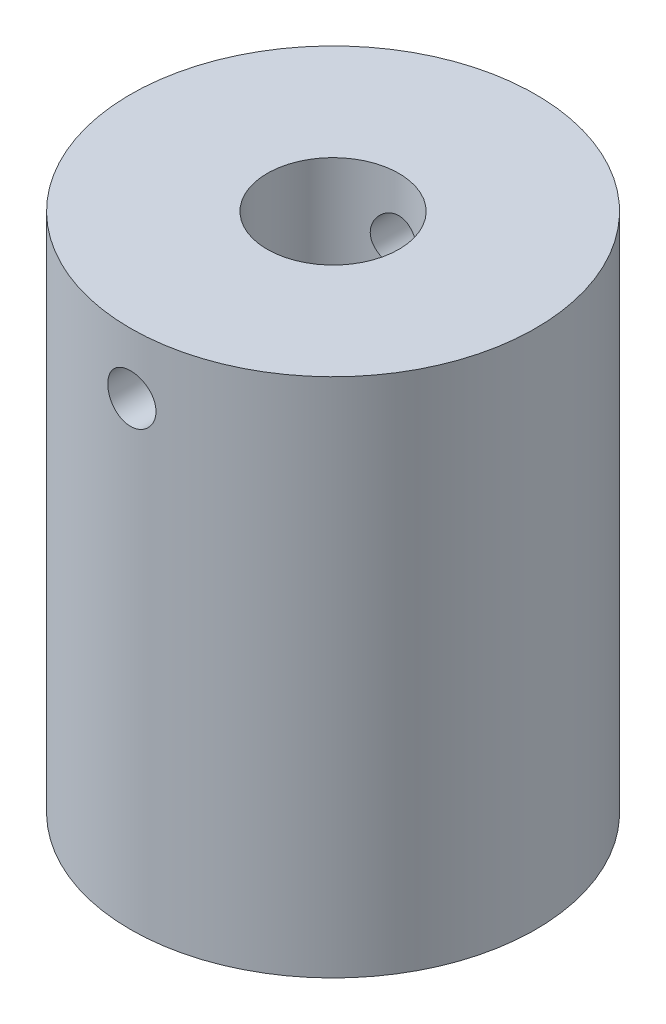
ISO-10303-21;
HEADER;
FILE_DESCRIPTION(('STEP AP214'),'2;1');
FILE_NAME('part.step','',(''),(''),'','','');
FILE_SCHEMA(('AUTOMOTIVE_DESIGN { 1 0 10303 214 1 1 1 1 }'));
ENDSEC;
DATA;
#1=APPLICATION_CONTEXT('core data for automotive mechanical design processes');
#2=APPLICATION_PROTOCOL_DEFINITION('international standard','automotive_design',2000,#1);
#3=PRODUCT_CONTEXT('',#1,'mechanical');
#4=PRODUCT('Part','Part','',(#3));
#5=PRODUCT_RELATED_PRODUCT_CATEGORY('part','',(#4));
#6=PRODUCT_DEFINITION_FORMATION('','',#4);
#7=PRODUCT_DEFINITION_CONTEXT('part definition',#1,'design');
#8=PRODUCT_DEFINITION('design','',#6,#7);
#9=PRODUCT_DEFINITION_SHAPE('','',#8);
#10=(LENGTH_UNIT() NAMED_UNIT(*) SI_UNIT(.MILLI.,.METRE.));
#11=(NAMED_UNIT(*) PLANE_ANGLE_UNIT() SI_UNIT($,.RADIAN.));
#12=(NAMED_UNIT(*) SI_UNIT($,.STERADIAN.) SOLID_ANGLE_UNIT());
#13=UNCERTAINTY_MEASURE_WITH_UNIT(LENGTH_MEASURE(1.E-05),#10,'distance_accuracy_value','');
#14=(GEOMETRIC_REPRESENTATION_CONTEXT(3) GLOBAL_UNCERTAINTY_ASSIGNED_CONTEXT((#13)) GLOBAL_UNIT_ASSIGNED_CONTEXT((#10,
#11,#12)) REPRESENTATION_CONTEXT('',''));
#15=CARTESIAN_POINT('',(0.,0.,0.));
#16=DIRECTION('',(0.,0.,1.));
#17=DIRECTION('',(1.,0.,0.));
#18=AXIS2_PLACEMENT_3D('',#15,#16,#17);
#19=CARTESIAN_POINT('',(7.90631053445259E-08,25.6615410821023,-0.00230135223591423));
#20=DIRECTION('',(0.,-1.,0.));
#21=DIRECTION('',(0.,0.,-1.));
#22=AXIS2_PLACEMENT_3D('',#19,#20,#21);
#23=CYLINDRICAL_SURFACE('',#22,12.699999999365);
#24=CARTESIAN_POINT('',(7.90631053445259E-08,23.3628408916023,-12.7023013516009));
#25=CARTESIAN_POINT('',(-0.0845696148416569,23.3628372793064,-12.7023002188469));
#26=CARTESIAN_POINT('',(-0.169192954352257,23.3557184089442,-12.7014476876862));
#27=CARTESIAN_POINT('',(-0.336087114147762,23.3274309365894,-12.6981287688739));
#28=CARTESIAN_POINT('',(-0.418355346410262,23.3062474539306,-12.6956606719574));
#29=CARTESIAN_POINT('',(-0.578098820563869,23.250461765435,-12.6893888117648));
#30=CARTESIAN_POINT('',(-0.655577164458697,23.2158683518949,-12.685585923806));
#31=CARTESIAN_POINT('',(-0.803613149594646,23.1342634734478,-12.6770680287157));
#32=CARTESIAN_POINT('',(-0.874172023798719,23.0872542264206,-12.67235318453));
#33=CARTESIAN_POINT('',(-1.00673500183028,22.9819000545557,-12.6625118213095));
#34=CARTESIAN_POINT('',(-1.06869945975999,22.9235054029881,-12.6573835564462));
#35=CARTESIAN_POINT('',(-1.18197338123497,22.797144671766,-12.6473075074437));
#36=CARTESIAN_POINT('',(-1.23328231532977,22.7291781167853,-12.6423597322829));
#37=CARTESIAN_POINT('',(-1.32393470667361,22.5853474653493,-12.6331875587314));
#38=CARTESIAN_POINT('',(-1.36324131812571,22.509459990578,-12.6289654049212));
#39=CARTESIAN_POINT('',(-1.42853800477977,22.352102733054,-12.6217452624361));
#40=CARTESIAN_POINT('',(-1.4545285387531,22.2706331427284,-12.6187472315879));
#41=CARTESIAN_POINT('',(-1.49233549977857,22.1048341923155,-12.6143312753195));
#42=CARTESIAN_POINT('',(-1.50421860866326,22.0205202389618,-12.6129059185885));
#43=CARTESIAN_POINT('',(-1.51367968431702,21.8510836461911,-12.6117738850823));
#44=CARTESIAN_POINT('',(-1.51125817431822,21.7659610364669,-12.6120671454439));
#45=CARTESIAN_POINT('',(-1.49223354350995,21.5977868437959,-12.6143324124698));
#46=CARTESIAN_POINT('',(-1.47570370620829,21.5147268372732,-12.6162957440323));
#47=CARTESIAN_POINT('',(-1.42904590124534,21.3525681553089,-12.6216664027678));
#48=CARTESIAN_POINT('',(-1.39891768174514,21.2734695532617,-12.6250737566838));
#49=CARTESIAN_POINT('',(-1.32583902355308,21.1212503376166,-12.6329584167725));
#50=CARTESIAN_POINT('',(-1.28285656594804,21.0481452396541,-12.6374383891322));
#51=CARTESIAN_POINT('',(-1.18531247627814,20.9101581741052,-12.6469614019277));
#52=CARTESIAN_POINT('',(-1.13075036403498,20.8452765477031,-12.6520044657093));
#53=CARTESIAN_POINT('',(-1.01118881970079,20.7251526874327,-12.6621240309365));
#54=CARTESIAN_POINT('',(-0.946126188721636,20.6699733380998,-12.667200544078));
#55=CARTESIAN_POINT('',(-0.807628575958914,20.5713094218838,-12.6767854127394));
#56=CARTESIAN_POINT('',(-0.73419357782012,20.5278248778468,-12.6812937671494));
#57=CARTESIAN_POINT('',(-0.580988565438194,20.4537855616742,-12.6892367824864));
#58=CARTESIAN_POINT('',(-0.501216725135993,20.4232345327008,-12.6926711325047));
#59=CARTESIAN_POINT('',(-0.337625447311526,20.3759783993849,-12.6980762867787));
#60=CARTESIAN_POINT('',(-0.253806181592356,20.3592727078882,-12.7000471530976));
#61=CARTESIAN_POINT('',(-0.085043323164782,20.3402625166868,-12.7022952366158));
#62=CARTESIAN_POINT('',(-0.000109623124884477,20.3378713519438,-12.7025826458111));
#63=CARTESIAN_POINT('',(0.168948247590581,20.3473296628584,-12.7014589010404));
#64=CARTESIAN_POINT('',(0.253072433825441,20.3591788642552,-12.7000477797871));
#65=CARTESIAN_POINT('',(0.417869030020552,20.3967095787821,-12.6956919164251));
#66=CARTESIAN_POINT('',(0.498550937690297,20.4223499620032,-12.6927517353424));
#67=CARTESIAN_POINT('',(0.654469354490724,20.4866925712086,-12.6856670894488));
#68=CARTESIAN_POINT('',(0.729705694557353,20.5253952025146,-12.6815225872682));
#69=CARTESIAN_POINT('',(0.872985594636391,20.6149747250107,-12.6724663278202));
#70=CARTESIAN_POINT('',(0.940993736402984,20.6659079058374,-12.6675510605966));
#71=CARTESIAN_POINT('',(1.0675268657601,20.7784228096483,-12.6575146247456));
#72=CARTESIAN_POINT('',(1.12605151322184,20.8400049143961,-12.6523934487413));
#73=CARTESIAN_POINT('',(1.23226214051118,20.9724504114479,-12.6424911353638));
#74=CARTESIAN_POINT('',(1.2798908174261,21.0433599173393,-12.6377118826662));
#75=CARTESIAN_POINT('',(1.362562137828,21.1922226410045,-12.6290649791939));
#76=CARTESIAN_POINT('',(1.39760501344141,21.2701757288367,-12.6251973116068));
#77=CARTESIAN_POINT('',(1.45401639486109,21.4307249085801,-12.6188240897818));
#78=CARTESIAN_POINT('',(1.47541767134513,21.5133093510393,-12.6163152734264));
#79=CARTESIAN_POINT('',(1.50404410335422,21.6809313612765,-12.6129342754558));
#80=CARTESIAN_POINT('',(1.51126985182022,21.7659688262973,-12.6120620253856));
#81=CARTESIAN_POINT('',(1.51132992914492,21.9355130579527,-12.6120547795347));
#82=CARTESIAN_POINT('',(1.50425427669386,22.020019806427,-12.6129089171849));
#83=CARTESIAN_POINT('',(1.47610254031038,22.1866341621517,-12.6162348957623));
#84=CARTESIAN_POINT('',(1.45502645069213,22.2687417684277,-12.6187067373464));
#85=CARTESIAN_POINT('',(1.39949942697333,22.4282181143624,-12.6249863401038));
#86=CARTESIAN_POINT('',(1.36505239903992,22.5055882303892,-12.6287937110861));
#87=CARTESIAN_POINT('',(1.28377023251956,22.6534641102934,-12.6373160634371));
#88=CARTESIAN_POINT('',(1.23693499644776,22.7239698201476,-12.6420310519478));
#89=CARTESIAN_POINT('',(1.1318706581952,22.856576088214,-12.6518729568715));
#90=CARTESIAN_POINT('',(1.0735744257693,22.9186232901208,-12.6570021899715));
#91=CARTESIAN_POINT('',(0.947381782618675,23.0320900026687,-12.6670739800853));
#92=CARTESIAN_POINT('',(0.879483103096344,23.0835069945912,-12.6720164926313));
#93=CARTESIAN_POINT('',(0.735746014907268,23.1744028201091,-12.6811766140111));
#94=CARTESIAN_POINT('',(0.659880954149518,23.213839742857,-12.6853916561705));
#95=CARTESIAN_POINT('',(0.502598939540561,23.2793588210675,-12.692595545792));
#96=CARTESIAN_POINT('',(0.421188189488289,23.3054556304696,-12.6955857380151));
#97=CARTESIAN_POINT('',(0.282787955443692,23.3372387422627,-12.6992742077948));
#98=CARTESIAN_POINT('',(0.226674561464741,23.3468259292641,-12.7004039184879));
#99=CARTESIAN_POINT('',(0.113715554453711,23.3596281979289,-12.7019178688512));
#100=CARTESIAN_POINT('',(0.0568699461514096,23.3628433207323,-12.7023021133344));
#101=CARTESIAN_POINT('',(7.90631053445259E-08,23.3628408916023,-12.7023013516009));
#102=B_SPLINE_CURVE_WITH_KNOTS('',3,(#24,#25,#26,#27,#28,#29,#30,#31,#32,#33,#34,#35,#36,#37,
#38,#39,#40,#41,#42,#43,#44,#45,#46,#47,#48,#49,#50,#51,#52,#53,#54,#55,#56,#57,#58,#59,#60,#61,
#62,#63,#64,#65,#66,#67,#68,#69,#70,#71,#72,#73,#74,#75,#76,#77,#78,#79,#80,#81,#82,#83,#84,#85,
#86,#87,#88,#89,#90,#91,#92,#93,#94,#95,#96,#97,#98,#99,#100,#101),.UNSPECIFIED.,.T.,.F.,(4,2,2,
2,2,2,2,2,2,2,2,2,2,2,2,2,2,2,2,2,2,2,2,2,2,2,2,2,2,2,2,2,2,2,2,2,2,2,4),(0.,0.253501370087271,
0.507271378460939,0.760875281755719,1.01443391358374,1.26912584882524,1.52383043614445,
1.77930925426548,2.03477926992585,2.28903688092427,2.54328519178514,2.79622083110806,
3.04916115493275,3.30273685710509,3.55632307646075,3.81149673057787,4.06667088317947,
4.32191883677983,4.57715596525029,4.83084622533101,5.08453159956967,5.33746456063073,
5.59040537092786,5.84453340873244,6.0986705589099,6.35411499505537,6.60955471966543,
6.86437847557184,7.11919157235804,7.37240576951553,7.62562006950802,7.8787604514376,
8.13190282542968,8.38657464501751,8.64130673748512,8.89691998079046,9.15225182962976,
9.32272285342816,9.4931927766113),.UNSPECIFIED.);
#103=CARTESIAN_POINT('',(7.90631053445259E-08,23.3628408916023,-12.7023013516009));
#104=VERTEX_POINT('',#103);
#105=EDGE_CURVE('E114',#104,#104,#102,.T.);
#106=ORIENTED_EDGE('',*,*,#105,.T.);
#107=EDGE_LOOP('',(#106));
#108=FACE_BOUND('',#107,.T.);
#109=CARTESIAN_POINT('',(1.51130007906311,21.8515408916023,12.6074556753151));
#110=CARTESIAN_POINT('',(1.51129646465554,21.7669735879391,12.6074568383633));
#111=CARTESIAN_POINT('',(1.50417798310974,21.6823526315239,12.6083155823394));
#112=CARTESIAN_POINT('',(1.47589219546105,21.5154634228257,12.6116566880572));
#113=CARTESIAN_POINT('',(1.45471000030889,21.4331977604444,12.6141407704805));
#114=CARTESIAN_POINT('',(1.39892807781605,21.2734597215588,12.6204472918536));
#115=CARTESIAN_POINT('',(1.36433720387139,21.1959842212936,12.6242688475437));
#116=CARTESIAN_POINT('',(1.28273830690039,21.0479530052959,12.6328186530495));
#117=CARTESIAN_POINT('',(1.23573249556647,20.9773960601059,12.6375467413274));
#118=CARTESIAN_POINT('',(1.13038180195701,20.8448309221589,12.647403808429));
#119=CARTESIAN_POINT('',(1.07198642467054,20.7828629819718,12.6525345093337));
#120=CARTESIAN_POINT('',(0.945622777438378,20.6695823344357,12.6626031815053));
#121=CARTESIAN_POINT('',(0.87765404169594,20.6182701458485,12.6675411433796));
#122=CARTESIAN_POINT('',(0.733821461358817,20.5276143367819,12.6766854573977));
#123=CARTESIAN_POINT('',(0.657934613572194,20.4883069683742,12.6808895774289));
#124=CARTESIAN_POINT('',(0.500578718216935,20.423008709568,12.6880736315433));
#125=CARTESIAN_POINT('',(0.419109859365843,20.3970173692307,12.6910536069889));
#126=CARTESIAN_POINT('',(0.253313222397829,20.359208744633,12.6954414894544));
#127=CARTESIAN_POINT('',(0.1690008673162,20.3473247007621,12.6968567987));
#128=CARTESIAN_POINT('',(-0.000432590595784326,20.337861201298,12.6979811348627));
#129=CARTESIAN_POINT('',(-0.0855536643158406,20.3402812327542,12.6976902229656));
#130=CARTESIAN_POINT('',(-0.253734338602587,20.3593035081876,12.6954409012311));
#131=CARTESIAN_POINT('',(-0.336802188340548,20.3758339575271,12.6934909329343));
#132=CARTESIAN_POINT('',(-0.498976240186795,20.4224956995735,12.6881521285708));
#133=CARTESIAN_POINT('',(-0.578082372980451,20.4526272301541,12.6847632673388));
#134=CARTESIAN_POINT('',(-0.730310773705238,20.5257127737567,12.6769129622865));
#135=CARTESIAN_POINT('',(-0.80341789775032,20.5686980380691,12.6724489095581));
#136=CARTESIAN_POINT('',(-0.941407828039552,20.6662481340174,12.6629480421221));
#137=CARTESIAN_POINT('',(-1.00629029217783,20.7208134470749,12.6579112036061));
#138=CARTESIAN_POINT('',(-1.12641059124666,20.8403772798801,12.6477920253198));
#139=CARTESIAN_POINT('',(-1.18158618629783,20.9054383404863,12.6427095969754));
#140=CARTESIAN_POINT('',(-1.28024327336548,21.0439314672289,12.6331029418733));
#141=CARTESIAN_POINT('',(-1.32372473463839,21.1173635553718,12.6285787165831));
#142=CARTESIAN_POINT('',(-1.39776182590805,21.2705677418682,12.6206006715521));
#143=CARTESIAN_POINT('',(-1.42831276740956,21.3503421274518,12.6171472401931));
#144=CARTESIAN_POINT('',(-1.47556794752441,21.5139389433434,12.611709505492));
#145=CARTESIAN_POINT('',(-1.49227278896554,21.5977611972483,12.6097251381906));
#146=CARTESIAN_POINT('',(-1.51127976958748,21.7665255049512,12.6074617646801));
#147=CARTESIAN_POINT('',(-1.51366936471355,21.8514575755695,12.6071724034346));
#148=CARTESIAN_POINT('',(-1.50420849609675,22.0205118117644,12.6083044362357));
#149=CARTESIAN_POINT('',(-1.49235830677846,22.1046339929175,12.6097257973139));
#150=CARTESIAN_POINT('',(-1.45482776892708,22.2694203128179,12.614109683492));
#151=CARTESIAN_POINT('',(-1.42918950913326,22.3500941729266,12.6170675175036));
#152=CARTESIAN_POINT('',(-1.36485383809236,22.5059974325426,12.6241872765211));
#153=CARTESIAN_POINT('',(-1.32615600893283,22.5812266577254,12.6283492400591));
#154=CARTESIAN_POINT('',(-1.23658360865817,22.7245016135085,12.6374331880848));
#155=CARTESIAN_POINT('',(-1.18565152928477,22.7925111625344,12.6423587218228));
#156=CARTESIAN_POINT('',(-1.07313799056379,22.9190476433686,12.6524035683106));
#157=CARTESIAN_POINT('',(-1.01155615646337,22.977574241342,12.6575228878745));
#158=CARTESIAN_POINT('',(-0.879109828447839,23.0837892215384,12.6674101613913));
#159=CARTESIAN_POINT('',(-0.808199168770065,23.1314202434508,12.6721761703439));
#160=CARTESIAN_POINT('',(-0.659333499043033,23.2140956760769,12.6807909484723));
#161=CARTESIAN_POINT('',(-0.581378619517785,23.2491403199466,12.6846397346388));
#162=CARTESIAN_POINT('',(-0.420830459065367,23.305552841278,12.6909777460553));
#163=CARTESIAN_POINT('',(-0.338249099075065,23.3269542556089,12.6934703028682));
#164=CARTESIAN_POINT('',(-0.170633601013161,23.3555820073064,12.6968288072524));
#165=CARTESIAN_POINT('',(-0.0855995628129667,23.3628089210246,12.6976948209608));
#166=CARTESIAN_POINT('',(0.0839465611251043,23.3628724549088,12.6977024246983));
#167=CARTESIAN_POINT('',(0.168458626952902,23.3557976748788,12.6968546318565));
#168=CARTESIAN_POINT('',(0.335083838471384,23.3276458153609,12.6935509346006));
#169=CARTESIAN_POINT('',(0.417196984783226,23.3065687394988,12.691095030603));
#170=CARTESIAN_POINT('',(0.576684641896902,23.2510375902454,12.6848499256681));
#171=CARTESIAN_POINT('',(0.654060500611336,23.2165873426285,12.6810611060782));
#172=CARTESIAN_POINT('',(0.801946526439298,23.1352969544779,12.6725704327158));
#173=CARTESIAN_POINT('',(0.87245664309923,23.0884567229046,12.6678685722346));
#174=CARTESIAN_POINT('',(1.0050628167079,22.9833868222213,12.6580423669985));
#175=CARTESIAN_POINT('',(1.06710642107235,22.9250911698521,12.6529156791714));
#176=CARTESIAN_POINT('',(1.1805661456561,22.798901176337,12.6428367261954));
#177=CARTESIAN_POINT('',(1.23197973763901,22.7310045581536,12.6378845027728));
#178=CARTESIAN_POINT('',(1.32287182441588,22.5872692167015,12.6286966651552));
#179=CARTESIAN_POINT('',(1.36230781818597,22.5114034680658,12.6244636257679));
#180=CARTESIAN_POINT('',(1.42782497017739,22.3541200088967,12.6172236918261));
#181=CARTESIAN_POINT('',(1.45392079393157,22.2727085072032,12.6142154515312));
#182=CARTESIAN_POINT('',(1.48570118392937,22.1343108989567,12.6105035390795));
#183=CARTESIAN_POINT('',(1.49528714589229,22.0782010740488,12.609366206727));
#184=CARTESIAN_POINT('',(1.50808778759039,21.9652492135055,12.6078418862908));
#185=CARTESIAN_POINT('',(1.51130250952906,21.9084071827228,12.6074548932369));
#186=CARTESIAN_POINT('',(1.51130007906311,21.8515408916023,12.6074556753151));
#187=B_SPLINE_CURVE_WITH_KNOTS('',3,(#109,#110,#111,#112,#113,#114,#115,#116,#117,#118,#119,
#120,#121,#122,#123,#124,#125,#126,#127,#128,#129,#130,#131,#132,#133,#134,#135,#136,#137,#138,
#139,#140,#141,#142,#143,#144,#145,#146,#147,#148,#149,#150,#151,#152,#153,#154,#155,#156,#157,
#158,#159,#160,#161,#162,#163,#164,#165,#166,#167,#168,#169,#170,#171,#172,#173,#174,#175,#176,
#177,#178,#179,#180,#181,#182,#183,#184,#185,#186),.UNSPECIFIED.,.T.,.F.,(4,2,2,2,2,2,2,2,2,2,2,
2,2,2,2,2,2,2,2,2,2,2,2,2,2,2,2,2,2,2,2,2,2,2,2,2,2,2,4),(0.,0.253494189664619,
0.507257178789039,0.760852899539713,1.01440347323576,1.26910480624692,1.52381853616768,
1.77929401196897,2.03476085487134,2.28901387673195,2.5432577810215,2.79621573585145,
3.04917811491627,3.3027605925517,3.55635361452693,3.81151767781092,4.06668241190792,
4.32193958744478,4.57718564907915,4.83087073599217,5.08455093404545,5.33746112052371,
5.59037940101609,5.84451065008353,6.0986508435628,6.35409966417613,6.60954375248824,
6.86435747918027,7.11916084463603,7.37239052656431,7.62562014292247,7.87877736910828,
8.13193645550505,8.3865989024068,8.64132184858857,8.89693836294813,9.15227325735621,
9.32273358009403,9.49319277368794),.UNSPECIFIED.);
#188=CARTESIAN_POINT('',(1.51130007906311,21.8515408916023,12.6074556753151));
#189=VERTEX_POINT('',#188);
#190=EDGE_CURVE('E149',#189,#189,#187,.T.);
#191=ORIENTED_EDGE('',*,*,#190,.T.);
#192=EDGE_LOOP('',(#191));
#193=FACE_BOUND('',#192,.T.);
#194=CARTESIAN_POINT('',(7.90631053445259E-08,25.6615410821023,-0.00230135223591423));
#195=DIRECTION('',(0.,1.,0.));
#196=DIRECTION('',(0.,0.,1.));
#197=AXIS2_PLACEMENT_3D('',#194,#195,#196);
#198=CIRCLE('',#197,12.699999999365);
#199=CARTESIAN_POINT('',(7.90631053445259E-08,25.6615410821023,12.6976986471291));
#200=VERTEX_POINT('',#199);
#201=EDGE_CURVE('E11',#200,#200,#198,.T.);
#202=ORIENTED_EDGE('',*,*,#201,.F.);
#203=EDGE_LOOP('',(#202));
#204=FACE_BOUND('',#203,.T.);
#205=CARTESIAN_POINT('',(7.90631053445259E-08,-6.97745891853275,-0.00230135223591423));
#206=DIRECTION('',(0.,1.,0.));
#207=DIRECTION('',(0.,0.,1.));
#208=AXIS2_PLACEMENT_3D('',#205,#206,#207);
#209=CIRCLE('',#208,12.699999999365);
#210=CARTESIAN_POINT('',(7.90631053445259E-08,-6.97745891853275,12.6976986471291));
#211=VERTEX_POINT('',#210);
#212=EDGE_CURVE('E49',#211,#211,#209,.T.);
#213=ORIENTED_EDGE('',*,*,#212,.T.);
#214=EDGE_LOOP('',(#213));
#215=FACE_BOUND('',#214,.T.);
#216=ADVANCED_FACE('F35',(#108,#193,#204,#215),#23,.T.);
#217=CARTESIAN_POINT('',(7.90631053445259E-08,25.6615410821023,-0.00230135223591423));
#218=DIRECTION('',(0.,1.,0.));
#219=DIRECTION('',(0.,0.,1.));
#220=AXIS2_PLACEMENT_3D('',#217,#218,#219);
#221=PLANE('',#220);
#222=CARTESIAN_POINT('',(7.90631053445259E-08,25.6615410821023,-0.00230135223591423));
#223=DIRECTION('',(0.,1.,0.));
#224=DIRECTION('',(0.,0.,1.));
#225=AXIS2_PLACEMENT_3D('',#222,#223,#224);
#226=CIRCLE('',#225,4.12750009525);
#227=CARTESIAN_POINT('',(7.90631053445259E-08,25.6615410821023,4.12519874301409));
#228=VERTEX_POINT('',#227);
#229=EDGE_CURVE('E120',#228,#228,#226,.T.);
#230=ORIENTED_EDGE('',*,*,#229,.F.);
#231=EDGE_LOOP('',(#230));
#232=FACE_BOUND('',#231,.T.);
#233=ORIENTED_EDGE('',*,*,#201,.T.);
#234=EDGE_LOOP('',(#233));
#235=FACE_BOUND('',#234,.T.);
#236=ADVANCED_FACE('F163',(#232,#235),#221,.T.);
#237=CARTESIAN_POINT('',(7.90631053445259E-08,-6.97745891853275,-0.00230135223591423));
#238=DIRECTION('',(0.,1.,0.));
#239=DIRECTION('',(0.,0.,1.));
#240=AXIS2_PLACEMENT_3D('',#237,#238,#239);
#241=PLANE('',#240);
#242=CARTESIAN_POINT('',(7.90631053445259E-08,-6.97745891853275,-0.00230135223591423));
#243=DIRECTION('',(0.,-1.,0.));
#244=DIRECTION('',(0.,0.,-1.));
#245=AXIS2_PLACEMENT_3D('',#242,#243,#244);
#246=CIRCLE('',#245,4.111625);
#247=CARTESIAN_POINT('',(-2.57148896190688,-6.97745891853275,3.2059542879518));
#248=VERTEX_POINT('',#247);
#249=CARTESIAN_POINT('',(2.5714891200331,-6.97745891853275,3.20595428795179));
#250=VERTEX_POINT('',#249);
#251=EDGE_CURVE('E92',#248,#250,#246,.T.);
#252=ORIENTED_EDGE('',*,*,#251,.F.);
#253=CARTESIAN_POINT('',(-2.21013062535802,-6.97745891853275,3.46479864776409));
#254=DIRECTION('',(0.,-1.,0.));
#255=DIRECTION('',(0.,0.,-1.));
#256=AXIS2_PLACEMENT_3D('',#253,#254,#255);
#257=CIRCLE('',#256,0.4445);
#258=CARTESIAN_POINT('',(-1.76563062535802,-6.97745891853275,3.46479864776409));
#259=VERTEX_POINT('',#258);
#260=EDGE_CURVE('E57',#259,#248,#257,.T.);
#261=ORIENTED_EDGE('',*,*,#260,.F.);
#262=DIRECTION('',(-1.,0.,0.));
#263=VECTOR('',#262,1.);
#264=CARTESIAN_POINT('',(-1.76563062535802,-6.97745891853275,3.46479864776409));
#265=LINE('',#264,#263);
#266=CARTESIAN_POINT('',(1.76563078348423,-6.97745891853275,3.46479864776409));
#267=VERTEX_POINT('',#266);
#268=EDGE_CURVE('E108',#267,#259,#265,.T.);
#269=ORIENTED_EDGE('',*,*,#268,.F.);
#270=CARTESIAN_POINT('',(2.21013078348423,-6.97745891853275,3.46479864776409));
#271=DIRECTION('',(0.,-1.,0.));
#272=DIRECTION('',(0.,0.,1.));
#273=AXIS2_PLACEMENT_3D('',#270,#271,#272);
#274=CIRCLE('',#273,0.4445);
#275=EDGE_CURVE('E116',#250,#267,#274,.T.);
#276=ORIENTED_EDGE('',*,*,#275,.F.);
#277=EDGE_LOOP('',(#252,#261,#269,#276));
#278=FACE_BOUND('',#277,.T.);
#279=ORIENTED_EDGE('',*,*,#212,.F.);
#280=EDGE_LOOP('',(#279));
#281=FACE_BOUND('',#280,.T.);
#282=ADVANCED_FACE('F170',(#278,#281),#241,.F.);
#283=CARTESIAN_POINT('',(7.90631053445259E-08,16.1365410814672,-0.00230135223591423));
#284=DIRECTION('',(0.,1.,0.));
#285=DIRECTION('',(0.,0.,1.));
#286=AXIS2_PLACEMENT_3D('',#283,#284,#285);
#287=CYLINDRICAL_SURFACE('',#286,4.12750009525);
#288=CARTESIAN_POINT('',(7.90631053445259E-08,20.3402408916023,4.12519874301409));
#289=CARTESIAN_POINT('',(0.0819826439587284,20.3402385965654,4.12520043091876));
#290=CARTESIAN_POINT('',(0.163949141274949,20.3469328445824,4.1227346266695));
#291=CARTESIAN_POINT('',(0.325440047786228,20.37343052471,4.11314363310427));
#292=CARTESIAN_POINT('',(0.404964680432564,20.3932327535661,4.10601887146064));
#293=CARTESIAN_POINT('',(0.559220006304251,20.4451572550145,4.08787684338552));
#294=CARTESIAN_POINT('',(0.63395937565245,20.477256448693,4.07686687174114));
#295=CARTESIAN_POINT('',(0.776988936417214,20.552749191011,4.05205693179222));
#296=CARTESIAN_POINT('',(0.845277481003816,20.5961456131552,4.03825625385767));
#297=CARTESIAN_POINT('',(0.976251453260944,20.6948514999613,4.00866681004515));
#298=CARTESIAN_POINT('',(1.03863865156891,20.7505402306879,3.99282361265155));
#299=CARTESIAN_POINT('',(1.15342594684918,20.8714446659787,3.96120934729768));
#300=CARTESIAN_POINT('',(1.20582319035699,20.9366630831714,3.94543830119794));
#301=CARTESIAN_POINT('',(1.30099581499166,21.0776384270017,3.91512847519634));
#302=CARTESIAN_POINT('',(1.34335741328853,21.1536899938607,3.90065440582409));
#303=CARTESIAN_POINT('',(1.41455705925836,21.3124522598147,3.87542003121165));
#304=CARTESIAN_POINT('',(1.44340022226041,21.3951604261716,3.86465832163497));
#305=CARTESIAN_POINT('',(1.48557966915842,21.5614627110123,3.84864712685581));
#306=CARTESIAN_POINT('',(1.49948303686824,21.6448930330656,3.84319685318486));
#307=CARTESIAN_POINT('',(1.51316147709097,21.8130668417949,3.83783653353387));
#308=CARTESIAN_POINT('',(1.5129420405922,21.8978098053001,3.83792433433372));
#309=CARTESIAN_POINT('',(1.49881617496981,22.0610966838326,3.84345648528684));
#310=CARTESIAN_POINT('',(1.48568555455156,22.1397198813187,3.84859720833232));
#311=CARTESIAN_POINT('',(1.4473888384873,22.2935579667649,3.86315309188983));
#312=CARTESIAN_POINT('',(1.42222101572147,22.3687723639282,3.87256886578416));
#313=CARTESIAN_POINT('',(1.36012075186262,22.5152785599005,3.89480394649761));
#314=CARTESIAN_POINT('',(1.322980901265,22.5864730505968,3.90768253858244));
#315=CARTESIAN_POINT('',(1.23813522329345,22.7218488297449,3.9353712956275));
#316=CARTESIAN_POINT('',(1.19042587060998,22.786027767566,3.95018210437237));
#317=CARTESIAN_POINT('',(1.08220720990636,22.9098600733006,3.98122042448921));
#318=CARTESIAN_POINT('',(1.02107522252281,22.968963018003,3.9974780180201));
#319=CARTESIAN_POINT('',(0.889576760744872,23.0762375417009,4.02876218138893));
#320=CARTESIAN_POINT('',(0.819208998555793,23.1244075937022,4.04378857907901));
#321=CARTESIAN_POINT('',(0.669885277521611,23.2090184262629,4.07119169529713));
#322=CARTESIAN_POINT('',(0.590822030085406,23.245283880952,4.08352797989203));
#323=CARTESIAN_POINT('',(0.427153523285981,23.3038191356911,4.10386261724865));
#324=CARTESIAN_POINT('',(0.342550622619864,23.3260948501096,4.11186280296374));
#325=CARTESIAN_POINT('',(0.174842927780474,23.3549786273411,4.12230571807376));
#326=CARTESIAN_POINT('',(0.0918821161597824,23.362328427936,4.12501129107647));
#327=CARTESIAN_POINT('',(-0.0741214929847283,23.3633011757805,4.12536708941372));
#328=CARTESIAN_POINT('',(-0.157164269683178,23.3569269994413,4.12301837407772));
#329=CARTESIAN_POINT('',(-0.317821840820911,23.3312021034679,4.11370310794548));
#330=CARTESIAN_POINT('',(-0.395524262093711,23.3123304788356,4.10690715378725));
#331=CARTESIAN_POINT('',(-0.546610767127922,23.2627701151483,4.0895516240037));
#332=CARTESIAN_POINT('',(-0.619994287615462,23.2320798386169,4.07899155872231));
#333=CARTESIAN_POINT('',(-0.762727925198259,23.1587881870069,4.05477851398848));
#334=CARTESIAN_POINT('',(-0.831900756220764,23.1158689127747,4.04104514032751));
#335=CARTESIAN_POINT('',(-0.96228925581174,23.0196997453432,4.01201371323848));
#336=CARTESIAN_POINT('',(-1.02350207427905,22.9664461688393,3.99671510285777));
#337=CARTESIAN_POINT('',(-1.13976712598985,22.8476534281828,3.96519364131599));
#338=CARTESIAN_POINT('',(-1.19429205594716,22.7815980080423,3.94896643026294));
#339=CARTESIAN_POINT('',(-1.291578874086,22.6409475558131,3.91824597230634));
#340=CARTESIAN_POINT('',(-1.33433995916121,22.5663519411857,3.90375284382508));
#341=CARTESIAN_POINT('',(-1.40686417884606,22.4102720650337,3.87822439441824));
#342=CARTESIAN_POINT('',(-1.43659408801398,22.3287708197411,3.8671979323967));
#343=CARTESIAN_POINT('',(-1.48172579697044,22.1614061907867,3.85014447156451));
#344=CARTESIAN_POINT('',(-1.497135902685,22.0755453663356,3.84411457481253));
#345=CARTESIAN_POINT('',(-1.51246745039387,21.9075822235025,3.83811011727111));
#346=CARTESIAN_POINT('',(-1.51328265004713,21.8255732488723,3.83778615937093));
#347=CARTESIAN_POINT('',(-1.50167125049677,21.6626532705599,3.84234146124987));
#348=CARTESIAN_POINT('',(-1.48924578979687,21.581742173082,3.84722027366664));
#349=CARTESIAN_POINT('',(-1.45218885474072,21.4255832817479,3.86134694329401));
#350=CARTESIAN_POINT('',(-1.42790535485974,21.3502406661288,3.87046991434065));
#351=CARTESIAN_POINT('',(-1.36812213470379,21.2046511697174,3.89198973055948));
#352=CARTESIAN_POINT('',(-1.33261964445891,21.134405552647,3.90438738412693));
#353=CARTESIAN_POINT('',(-1.24931840875006,20.9971414535009,3.93184069155628));
#354=CARTESIAN_POINT('',(-1.20098827499966,20.9304662336482,3.94699911340491));
#355=CARTESIAN_POINT('',(-1.09424256292731,20.8058859196553,3.97789645237306));
#356=CARTESIAN_POINT('',(-1.03582385651094,20.7479835561393,3.99363554834441));
#357=CARTESIAN_POINT('',(-0.907021647010326,20.639611594656,4.02487764576125));
#358=CARTESIAN_POINT('',(-0.836182238275552,20.5896664769927,4.04032838498221));
#359=CARTESIAN_POINT('',(-0.686577594169419,20.5024168820116,4.06840547180973));
#360=CARTESIAN_POINT('',(-0.607812361440421,20.4651124004798,4.0810318203579));
#361=CARTESIAN_POINT('',(-0.442572548459954,20.4037488617886,4.10226646476948));
#362=CARTESIAN_POINT('',(-0.355959640146198,20.3800241395879,4.11077260524304));
#363=CARTESIAN_POINT('',(-0.179557089401285,20.3482748901525,4.12223659077121));
#364=CARTESIAN_POINT('',(-0.0897688728742929,20.3402434046129,4.12519689479875));
#365=CARTESIAN_POINT('',(7.90631053445259E-08,20.3402408916023,4.12519874301409));
#366=B_SPLINE_CURVE_WITH_KNOTS('',3,(#288,#289,#290,#291,#292,#293,#294,#295,#296,#297,#298,
#299,#300,#301,#302,#303,#304,#305,#306,#307,#308,#309,#310,#311,#312,#313,#314,#315,#316,#317,
#318,#319,#320,#321,#322,#323,#324,#325,#326,#327,#328,#329,#330,#331,#332,#333,#334,#335,#336,
#337,#338,#339,#340,#341,#342,#343,#344,#345,#346,#347,#348,#349,#350,#351,#352,#353,#354,#355,
#356,#357,#358,#359,#360,#361,#362,#363,#364,#365),.UNSPECIFIED.,.T.,.F.,(4,2,2,2,2,2,2,2,2,2,2,
2,2,2,2,2,2,2,2,2,2,2,2,2,2,2,2,2,2,2,2,2,2,2,2,2,2,2,4),(0.,0.245616742292806,
0.491210941184837,0.736346449895917,0.981544371035892,1.23575532087849,1.49003877342584,
1.75346672705779,2.01679491982654,2.26973031495591,2.52256736864501,2.76108606471812,
2.99963899416186,3.24256944314782,3.48558104050188,3.74410547879011,4.00266600292921,
4.26487946941285,4.52698200654063,4.77570505137267,5.02437597136167,5.26402666328329,
5.50370854165707,5.75030070822352,5.9969809259998,6.25729165719529,6.51762015514528,
6.77860860248261,7.03944557383624,7.28425086281636,7.52903510380965,7.76703248156063,
8.00508866686127,8.25519314644804,8.50537531390449,8.76821917340098,9.03106294526925,
9.30012674478685,9.56907121562617),.UNSPECIFIED.);
#367=CARTESIAN_POINT('',(7.90631053445259E-08,20.3402408916023,4.12519874301409));
#368=VERTEX_POINT('',#367);
#369=EDGE_CURVE('E39',#368,#368,#366,.T.);
#370=ORIENTED_EDGE('',*,*,#369,.T.);
#371=EDGE_LOOP('',(#370));
#372=FACE_BOUND('',#371,.T.);
#373=CARTESIAN_POINT('',(1.51130007906311,21.8515408916023,-3.84316445136985));
#374=CARTESIAN_POINT('',(1.51130247281148,21.7697669486894,-3.84316228221068));
#375=CARTESIAN_POINT('',(1.50464093558328,21.6880092094503,-3.84580437011229));
#376=CARTESIAN_POINT('',(1.4782850549147,21.5269493939467,-3.85601742021855));
#377=CARTESIAN_POINT('',(1.45859060244802,21.447647338231,-3.86358842365583));
#378=CARTESIAN_POINT('',(1.40698069311716,21.2938665428998,-3.88268917991396));
#379=CARTESIAN_POINT('',(1.37509330318724,21.2193771818901,-3.89420983477633));
#380=CARTESIAN_POINT('',(1.300101429144,21.0767771858131,-3.9198974720438));
#381=CARTESIAN_POINT('',(1.25699375073377,21.0086683747417,-3.93406520772004));
#382=CARTESIAN_POINT('',(1.15859908021962,20.8775384298855,-3.96420232162385));
#383=CARTESIAN_POINT('',(1.10286778812404,20.8148623814521,-3.98022299467337));
#384=CARTESIAN_POINT('',(0.981751802169709,20.6995045770941,-4.0118317419968));
#385=CARTESIAN_POINT('',(0.916365174793076,20.6468248278061,-4.02741972887917));
#386=CARTESIAN_POINT('',(0.775196489750602,20.5513143444099,-4.05701295534812));
#387=CARTESIAN_POINT('',(0.69914733132517,20.5088557189957,-4.07095099986364));
#388=CARTESIAN_POINT('',(0.540385769815813,20.4374763752463,-4.09506005356732));
#389=CARTESIAN_POINT('',(0.457675572473633,20.4085511968645,-4.10523230356961));
#390=CARTESIAN_POINT('',(0.291565643225636,20.3662611871715,-4.12029969321228));
#391=CARTESIAN_POINT('',(0.208335548901286,20.3523029076066,-4.12539547508046));
#392=CARTESIAN_POINT('',(0.0405687467895905,20.3384446488859,-4.13045409763096));
#393=CARTESIAN_POINT('',(-0.0439675477101604,20.338540310526,-4.13041852993804));
#394=CARTESIAN_POINT('',(-0.207705282496558,20.3524347704209,-4.125347948276));
#395=CARTESIAN_POINT('',(-0.286970191153528,20.3655865498328,-4.12054899385917));
#396=CARTESIAN_POINT('',(-0.44207846000527,20.4041356246718,-4.10679753368965));
#397=CARTESIAN_POINT('',(-0.517921578986613,20.4295337819167,-4.09784473561899));
#398=CARTESIAN_POINT('',(-0.665318711860667,20.4921716949848,-4.07651754030255));
#399=CARTESIAN_POINT('',(-0.736795849381808,20.5295756488067,-4.06409602876762));
#400=CARTESIAN_POINT('',(-0.872633103325267,20.6150205080809,-4.03709645704276));
#401=CARTESIAN_POINT('',(-0.936990975468994,20.663064753533,-4.02251772017522));
#402=CARTESIAN_POINT('',(-1.06058417025129,20.7715762374638,-3.99174998294713));
#403=CARTESIAN_POINT('',(-1.11933047591777,20.8325886840095,-3.97551652735981));
#404=CARTESIAN_POINT('',(-1.22593617082097,20.9637066993221,-3.94392993823113));
#405=CARTESIAN_POINT('',(-1.27379308230844,21.0338143319014,-3.92857700563526));
#406=CARTESIAN_POINT('',(-1.35813635721038,21.1829767146299,-3.90021740404307));
#407=CARTESIAN_POINT('',(-1.39437224097054,21.2621841713619,-3.88726467675144));
#408=CARTESIAN_POINT('',(-1.45281028790938,21.4261752279438,-3.86579457780272));
#409=CARTESIAN_POINT('',(-1.47501982389342,21.5109558723853,-3.85727487638667));
#410=CARTESIAN_POINT('',(-1.50368843706249,21.6788732009328,-3.84618000328457));
#411=CARTESIAN_POINT('',(-1.51092045865071,21.7618585608135,-3.84331349387019));
#412=CARTESIAN_POINT('',(-1.51164996923046,21.9278885187761,-3.84302698253855));
#413=CARTESIAN_POINT('',(-1.50515066539705,22.0109330984974,-3.84560570879759));
#414=CARTESIAN_POINT('',(-1.47930162143688,22.1708629801188,-3.85562437117825));
#415=CARTESIAN_POINT('',(-1.46053544735288,22.2478580256006,-3.8628433123643));
#416=CARTESIAN_POINT('',(-1.41141199171987,22.3975760060685,-3.88107106368307));
#417=CARTESIAN_POINT('',(-1.38105240309809,22.4702980874152,-3.89208062810141));
#418=CARTESIAN_POINT('',(-1.30836045431586,22.6123403576622,-3.91714168438632));
#419=CARTESIAN_POINT('',(-1.26563335215964,22.6814411127877,-3.93128912199859));
#420=CARTESIAN_POINT('',(-1.16984505742467,22.8117677355264,-3.96086531217871));
#421=CARTESIAN_POINT('',(-1.11678023780823,22.8729908266683,-3.97629451336649));
#422=CARTESIAN_POINT('',(-0.998057091631693,22.9896270798193,-4.00781334341225));
#423=CARTESIAN_POINT('',(-0.931834655873991,23.0444722307108,-4.02388714217221));
#424=CARTESIAN_POINT('',(-0.790730377785661,23.1423325483466,-4.05399230135823));
#425=CARTESIAN_POINT('',(-0.715848598882373,23.185347801734,-4.06802367674278));
#426=CARTESIAN_POINT('',(-0.559685894380777,23.2580117564296,-4.09243825167365));
#427=CARTESIAN_POINT('',(-0.478434213318836,23.2877177722471,-4.10283705092401));
#428=CARTESIAN_POINT('',(-0.311622129613557,23.3328837610287,-4.11887213236672));
#429=CARTESIAN_POINT('',(-0.226063663804891,23.3483500785168,-4.12451053546939));
#430=CARTESIAN_POINT('',(-0.0582133471852648,23.3639376347417,-4.13019745480481));
#431=CARTESIAN_POINT('',(0.0239941279679271,23.3648675237948,-4.13054053163546));
#432=CARTESIAN_POINT('',(0.187342030090066,23.3534170478693,-4.12635671683318));
#433=CARTESIAN_POINT('',(0.268482574769616,23.3410381638854,-4.12183036706795));
#434=CARTESIAN_POINT('',(0.425555739879567,23.3038840214779,-4.10854537030972));
#435=CARTESIAN_POINT('',(0.501564276501359,23.2793924208214,-4.09988371838175));
#436=CARTESIAN_POINT('',(0.648405160968832,23.2189856647242,-4.07922807254598));
#437=CARTESIAN_POINT('',(0.719236529198391,23.1830683541738,-4.06723345002954));
#438=CARTESIAN_POINT('',(0.856897150047807,23.099145931608,-4.04050688780537));
#439=CARTESIAN_POINT('',(0.92344234412438,23.0507047548696,-4.02568271960803));
#440=CARTESIAN_POINT('',(1.04771283916926,22.9438085961273,-3.99512706908455));
#441=CARTESIAN_POINT('',(1.10543504197794,22.8853501117979,-3.97939527070637));
#442=CARTESIAN_POINT('',(1.21336777962119,22.7566182768735,-3.94784526575361));
#443=CARTESIAN_POINT('',(1.2630620903598,22.6859019823703,-3.93206165879627));
#444=CARTESIAN_POINT('',(1.34986870388884,22.5366218861964,-3.90309796306426));
#445=CARTESIAN_POINT('',(1.38698080699944,22.4580579600091,-3.88991791560952));
#446=CARTESIAN_POINT('',(1.44805237401861,22.2932139416186,-3.86759501832529));
#447=CARTESIAN_POINT('',(1.4716767111073,22.2067944210822,-3.85855605475163));
#448=CARTESIAN_POINT('',(1.5032947457746,22.0307558298174,-3.84634365068133));
#449=CARTESIAN_POINT('',(1.51129745629057,21.9411386344078,-3.84316682806539));
#450=CARTESIAN_POINT('',(1.51130007906311,21.8515408916023,-3.84316445136985));
#451=B_SPLINE_CURVE_WITH_KNOTS('',3,(#373,#374,#375,#376,#377,#378,#379,#380,#381,#382,#383,
#384,#385,#386,#387,#388,#389,#390,#391,#392,#393,#394,#395,#396,#397,#398,#399,#400,#401,#402,
#403,#404,#405,#406,#407,#408,#409,#410,#411,#412,#413,#414,#415,#416,#417,#418,#419,#420,#421,
#422,#423,#424,#425,#426,#427,#428,#429,#430,#431,#432,#433,#434,#435,#436,#437,#438,#439,#440,
#441,#442,#443,#444,#445,#446,#447,#448,#449,#450),.UNSPECIFIED.,.T.,.F.,(4,2,2,2,2,2,2,2,2,2,2,
2,2,2,2,2,2,2,2,2,2,2,2,2,2,2,2,2,2,2,2,2,2,2,2,2,2,2,4),(0.,0.244988591604183,
0.489979232675874,0.734409291841651,0.978909013904408,1.23393075642291,1.4890036374535,
1.75229660532394,2.01550274184283,2.26783560106944,2.52009019270642,2.76043804244557,
3.0008028087221,3.24460601964087,3.48848586941574,3.74602947545984,4.00363162395023,
4.26646186106693,4.5291538289355,4.77791220574079,5.02661248739236,5.26426687959828,
5.50196858935142,5.74830215421295,5.99472230254782,6.25590915296197,6.51709409037446,
6.77714319568062,7.03707637947532,7.2824947658259,7.5278858449489,7.76778456457177,
8.00772856058725,8.25753236282231,8.50742368218476,8.7697405437004,9.03206156799417,
9.3006446820638,9.56907279056582),.UNSPECIFIED.);
#452=CARTESIAN_POINT('',(1.51130007906311,21.8515408916023,-3.84316445136985));
#453=VERTEX_POINT('',#452);
#454=EDGE_CURVE('E129',#453,#453,#451,.T.);
#455=ORIENTED_EDGE('',*,*,#454,.T.);
#456=EDGE_LOOP('',(#455));
#457=FACE_BOUND('',#456,.T.);
#458=CARTESIAN_POINT('',(7.90631053445259E-08,16.1365410814672,-0.00230135223591423));
#459=DIRECTION('',(0.,1.,0.));
#460=DIRECTION('',(0.,0.,1.));
#461=AXIS2_PLACEMENT_3D('',#458,#459,#460);
#462=CIRCLE('',#461,4.12750009525);
#463=CARTESIAN_POINT('',(7.90631053445259E-08,16.1365410814672,4.12519874301409));
#464=VERTEX_POINT('',#463);
#465=EDGE_CURVE('E123',#464,#464,#462,.T.);
#466=ORIENTED_EDGE('',*,*,#465,.F.);
#467=EDGE_LOOP('',(#466));
#468=FACE_BOUND('',#467,.T.);
#469=ORIENTED_EDGE('',*,*,#229,.T.);
#470=EDGE_LOOP('',(#469));
#471=FACE_BOUND('',#470,.T.);
#472=ADVANCED_FACE('F134',(#372,#457,#468,#471),#287,.F.);
#473=CARTESIAN_POINT('',(7.90631053445259E-08,16.1365410814672,-0.00230135223591423));
#474=DIRECTION('',(0.,1.,0.));
#475=DIRECTION('',(0.,0.,1.));
#476=AXIS2_PLACEMENT_3D('',#473,#474,#475);
#477=PLANE('',#476);
#478=ORIENTED_EDGE('',*,*,#465,.T.);
#479=EDGE_LOOP('',(#478));
#480=FACE_BOUND('',#479,.T.);
#481=ADVANCED_FACE('F177',(#480),#477,.T.);
#482=CARTESIAN_POINT('',(-2.21013062535802,10.8025410814673,3.46479864776409));
#483=DIRECTION('',(0.,-1.,0.));
#484=DIRECTION('',(0.,0.,-1.));
#485=AXIS2_PLACEMENT_3D('',#482,#483,#484);
#486=CYLINDRICAL_SURFACE('',#485,0.4445);
#487=ORIENTED_EDGE('',*,*,#260,.T.);
#488=DIRECTION('',(0.,-1.,0.));
#489=VECTOR('',#488,1.);
#490=CARTESIAN_POINT('',(-2.57148896190688,10.8025410814673,3.2059542879518));
#491=LINE('',#490,#489);
#492=CARTESIAN_POINT('',(-2.57148896190688,10.8025410814673,3.2059542879518));
#493=VERTEX_POINT('',#492);
#494=EDGE_CURVE('E80',#493,#248,#491,.T.);
#495=ORIENTED_EDGE('',*,*,#494,.F.);
#496=CARTESIAN_POINT('',(-2.21013062535802,10.8025410814673,3.46479864776409));
#497=DIRECTION('',(0.,-1.,0.));
#498=DIRECTION('',(0.,0.,-1.));
#499=AXIS2_PLACEMENT_3D('',#496,#497,#498);
#500=CIRCLE('',#499,0.4445);
#501=CARTESIAN_POINT('',(-1.76563062535802,10.8025410814673,3.46479864776409));
#502=VERTEX_POINT('',#501);
#503=EDGE_CURVE('E106',#502,#493,#500,.T.);
#504=ORIENTED_EDGE('',*,*,#503,.F.);
#505=DIRECTION('',(0.,-1.,0.));
#506=VECTOR('',#505,1.);
#507=CARTESIAN_POINT('',(-1.76563062535802,10.8025410814673,3.46479864776409));
#508=LINE('',#507,#506);
#509=EDGE_CURVE('E65',#502,#259,#508,.T.);
#510=ORIENTED_EDGE('',*,*,#509,.T.);
#511=EDGE_LOOP('',(#487,#495,#504,#510));
#512=FACE_BOUND('',#511,.T.);
#513=ADVANCED_FACE('F183',(#512),#486,.F.);
#514=CARTESIAN_POINT('',(-1.76563062535802,10.8025410814673,3.46479864776409));
#515=DIRECTION('',(0.,0.,1.));
#516=DIRECTION('',(1.,0.,0.));
#517=AXIS2_PLACEMENT_3D('',#514,#515,#516);
#518=PLANE('',#517);
#519=ORIENTED_EDGE('',*,*,#268,.T.);
#520=ORIENTED_EDGE('',*,*,#509,.F.);
#521=DIRECTION('',(-1.,0.,0.));
#522=VECTOR('',#521,1.);
#523=CARTESIAN_POINT('',(-1.76563062535802,10.8025410814673,3.46479864776409));
#524=LINE('',#523,#522);
#525=CARTESIAN_POINT('',(1.76563078348423,10.8025410814673,3.46479864776409));
#526=VERTEX_POINT('',#525);
#527=EDGE_CURVE('E103',#526,#502,#524,.T.);
#528=ORIENTED_EDGE('',*,*,#527,.F.);
#529=DIRECTION('',(0.,-1.,0.));
#530=VECTOR('',#529,1.);
#531=CARTESIAN_POINT('',(1.76563078348423,10.8025410814673,3.46479864776409));
#532=LINE('',#531,#530);
#533=EDGE_CURVE('E96',#526,#267,#532,.T.);
#534=ORIENTED_EDGE('',*,*,#533,.T.);
#535=EDGE_LOOP('',(#519,#520,#528,#534));
#536=FACE_BOUND('',#535,.T.);
#537=ADVANCED_FACE('F181',(#536),#518,.F.);
#538=CARTESIAN_POINT('',(2.21013078348423,10.8025410814673,3.46479864776409));
#539=DIRECTION('',(0.,-1.,0.));
#540=DIRECTION('',(0.,0.,-1.));
#541=AXIS2_PLACEMENT_3D('',#538,#539,#540);
#542=CYLINDRICAL_SURFACE('',#541,0.4445);
#543=ORIENTED_EDGE('',*,*,#275,.T.);
#544=ORIENTED_EDGE('',*,*,#533,.F.);
#545=CARTESIAN_POINT('',(2.21013078348423,10.8025410814673,3.46479864776409));
#546=DIRECTION('',(0.,-1.,0.));
#547=DIRECTION('',(0.,0.,1.));
#548=AXIS2_PLACEMENT_3D('',#545,#546,#547);
#549=CIRCLE('',#548,0.4445);
#550=CARTESIAN_POINT('',(2.5714891200331,10.8025410814673,3.20595428795179));
#551=VERTEX_POINT('',#550);
#552=EDGE_CURVE('E99',#551,#526,#549,.T.);
#553=ORIENTED_EDGE('',*,*,#552,.F.);
#554=DIRECTION('',(0.,-1.,0.));
#555=VECTOR('',#554,1.);
#556=CARTESIAN_POINT('',(2.5714891200331,10.8025410814673,3.20595428795179));
#557=LINE('',#556,#555);
#558=EDGE_CURVE('E85',#551,#250,#557,.T.);
#559=ORIENTED_EDGE('',*,*,#558,.T.);
#560=EDGE_LOOP('',(#543,#544,#553,#559));
#561=FACE_BOUND('',#560,.T.);
#562=ADVANCED_FACE('F100',(#561),#542,.F.);
#563=CARTESIAN_POINT('',(7.90631053445259E-08,10.8025410814673,-0.00230135223591423));
#564=DIRECTION('',(0.,-1.,0.));
#565=DIRECTION('',(0.,0.,-1.));
#566=AXIS2_PLACEMENT_3D('',#563,#564,#565);
#567=CYLINDRICAL_SURFACE('',#566,4.111625);
#568=ORIENTED_EDGE('',*,*,#251,.T.);
#569=ORIENTED_EDGE('',*,*,#558,.F.);
#570=CARTESIAN_POINT('',(7.90631053445259E-08,10.8025410814673,-0.00230135223591423));
#571=DIRECTION('',(0.,-1.,0.));
#572=DIRECTION('',(0.,0.,-1.));
#573=AXIS2_PLACEMENT_3D('',#570,#571,#572);
#574=CIRCLE('',#573,4.111625);
#575=EDGE_CURVE('E89',#493,#551,#574,.T.);
#576=ORIENTED_EDGE('',*,*,#575,.F.);
#577=ORIENTED_EDGE('',*,*,#494,.T.);
#578=EDGE_LOOP('',(#568,#569,#576,#577));
#579=FACE_BOUND('',#578,.T.);
#580=ADVANCED_FACE('F87',(#579),#567,.F.);
#581=CARTESIAN_POINT('',(-2.21013062535802,10.8025410814673,3.46479864776409));
#582=DIRECTION('',(0.,-1.,0.));
#583=DIRECTION('',(0.,0.,-1.));
#584=AXIS2_PLACEMENT_3D('',#581,#582,#583);
#585=PLANE('',#584);
#586=ORIENTED_EDGE('',*,*,#503,.T.);
#587=ORIENTED_EDGE('',*,*,#575,.T.);
#588=ORIENTED_EDGE('',*,*,#552,.T.);
#589=ORIENTED_EDGE('',*,*,#527,.T.);
#590=EDGE_LOOP('',(#586,#587,#588,#589));
#591=FACE_BOUND('',#590,.T.);
#592=ADVANCED_FACE('F105',(#591),#585,.T.);
#593=CARTESIAN_POINT('',(7.90631053445259E-08,21.8515408916023,-12.7023013516009));
#594=DIRECTION('',(0.,0.,1.));
#595=DIRECTION('',(1.,0.,0.));
#596=AXIS2_PLACEMENT_3D('',#593,#594,#595);
#597=CYLINDRICAL_SURFACE('',#596,1.5113);
#598=ORIENTED_EDGE('',*,*,#454,.F.);
#599=EDGE_LOOP('',(#598));
#600=FACE_BOUND('',#599,.T.);
#601=ORIENTED_EDGE('',*,*,#105,.F.);
#602=EDGE_LOOP('',(#601));
#603=FACE_BOUND('',#602,.T.);
#604=ADVANCED_FACE('F138',(#600,#603),#597,.F.);
#605=ORIENTED_EDGE('',*,*,#369,.F.);
#606=EDGE_LOOP('',(#605));
#607=FACE_BOUND('',#606,.T.);
#608=ORIENTED_EDGE('',*,*,#190,.F.);
#609=EDGE_LOOP('',(#608));
#610=FACE_BOUND('',#609,.T.);
#611=ADVANCED_FACE('F142',(#607,#610),#597,.F.);
#612=CLOSED_SHELL('',(#216,#236,#282,#472,#481,#513,#537,#562,#580,#592,#604,#611));
#613=MANIFOLD_SOLID_BREP('B2',#612);
#614=ADVANCED_BREP_SHAPE_REPRESENTATION('',(#18,#613),#14);
#615=SHAPE_DEFINITION_REPRESENTATION(#9,#614);
ENDSEC;
END-ISO-10303-21;
